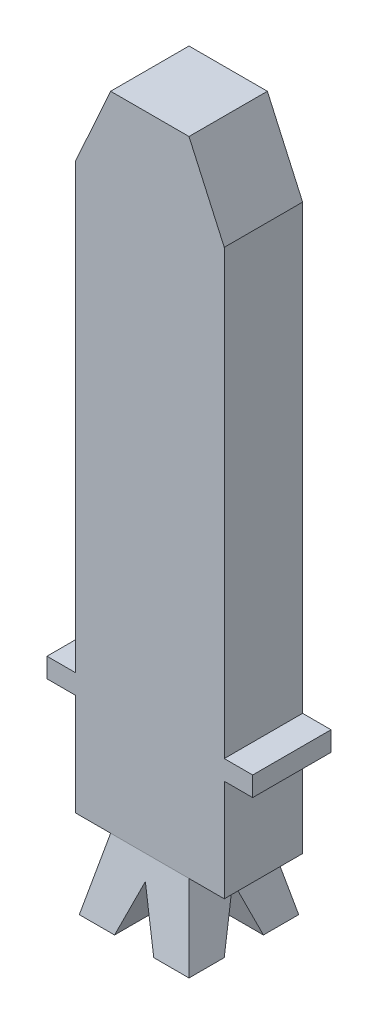
ISO-10303-21;
HEADER;
FILE_DESCRIPTION(('STEP AP214'),'2;1');
FILE_NAME('part.step','',(''),(''),'','','');
FILE_SCHEMA(('AUTOMOTIVE_DESIGN { 1 0 10303 214 1 1 1 1 }'));
ENDSEC;
DATA;
#1=APPLICATION_CONTEXT('core data for automotive mechanical design processes');
#2=APPLICATION_PROTOCOL_DEFINITION('international standard','automotive_design',2000,#1);
#3=PRODUCT_CONTEXT('',#1,'mechanical');
#4=PRODUCT('Part','Part','',(#3));
#5=PRODUCT_RELATED_PRODUCT_CATEGORY('part','',(#4));
#6=PRODUCT_DEFINITION_FORMATION('','',#4);
#7=PRODUCT_DEFINITION_CONTEXT('part definition',#1,'design');
#8=PRODUCT_DEFINITION('design','',#6,#7);
#9=PRODUCT_DEFINITION_SHAPE('','',#8);
#10=(LENGTH_UNIT() NAMED_UNIT(*) SI_UNIT(.MILLI.,.METRE.));
#11=(NAMED_UNIT(*) PLANE_ANGLE_UNIT() SI_UNIT($,.RADIAN.));
#12=(NAMED_UNIT(*) SI_UNIT($,.STERADIAN.) SOLID_ANGLE_UNIT());
#13=UNCERTAINTY_MEASURE_WITH_UNIT(LENGTH_MEASURE(1.E-05),#10,'distance_accuracy_value','');
#14=(GEOMETRIC_REPRESENTATION_CONTEXT(3) GLOBAL_UNCERTAINTY_ASSIGNED_CONTEXT((#13)) GLOBAL_UNIT_ASSIGNED_CONTEXT((#10,
#11,#12)) REPRESENTATION_CONTEXT('',''));
#15=CARTESIAN_POINT('',(0.,0.,0.));
#16=DIRECTION('',(0.,0.,1.));
#17=DIRECTION('',(1.,0.,0.));
#18=AXIS2_PLACEMENT_3D('',#15,#16,#17);
#19=CARTESIAN_POINT('',(0.,-4.9,0.));
#20=DIRECTION('',(0.,-1.,0.));
#21=DIRECTION('',(0.,0.,-1.));
#22=AXIS2_PLACEMENT_3D('',#19,#20,#21);
#23=PLANE('',#22);
#24=DIRECTION('',(-1.,0.,0.));
#25=VECTOR('',#24,1.);
#26=CARTESIAN_POINT('',(2.625,-4.9,1.5));
#27=LINE('',#26,#25);
#28=CARTESIAN_POINT('',(1.4,-4.9,1.5));
#29=VERTEX_POINT('',#28);
#30=CARTESIAN_POINT('',(0.5,-4.9,1.5));
#31=VERTEX_POINT('',#30);
#32=EDGE_CURVE('E479',#29,#31,#27,.T.);
#33=ORIENTED_EDGE('',*,*,#32,.F.);
#34=DIRECTION('',(0.,0.,1.));
#35=VECTOR('',#34,1.);
#36=CARTESIAN_POINT('',(1.4,-4.9,-0.4));
#37=LINE('',#36,#35);
#38=CARTESIAN_POINT('',(1.4,-4.9,2.4));
#39=VERTEX_POINT('',#38);
#40=EDGE_CURVE('E181',#29,#39,#37,.T.);
#41=ORIENTED_EDGE('',*,*,#40,.T.);
#42=DIRECTION('',(-1.,0.,0.));
#43=VECTOR('',#42,1.);
#44=CARTESIAN_POINT('',(1.4,-4.9,2.4));
#45=LINE('',#44,#43);
#46=CARTESIAN_POINT('',(0.500000000000001,-4.9,2.4));
#47=VERTEX_POINT('',#46);
#48=EDGE_CURVE('E356',#39,#47,#45,.T.);
#49=ORIENTED_EDGE('',*,*,#48,.T.);
#50=DIRECTION('',(0.,0.,1.));
#51=VECTOR('',#50,1.);
#52=CARTESIAN_POINT('',(0.500000000000001,-4.9,-0.4001));
#53=LINE('',#52,#51);
#54=EDGE_CURVE('E327',#31,#47,#53,.T.);
#55=ORIENTED_EDGE('',*,*,#54,.F.);
#56=EDGE_LOOP('',(#33,#41,#49,#55));
#57=FACE_BOUND('',#56,.T.);
#58=ADVANCED_FACE('F53',(#57),#23,.T.);
#59=CARTESIAN_POINT('',(-0.499999999999999,-4.9,1.5));
#60=VERTEX_POINT('',#59);
#61=CARTESIAN_POINT('',(-1.4,-4.9,1.5));
#62=VERTEX_POINT('',#61);
#63=EDGE_CURVE('E160',#60,#62,#27,.T.);
#64=ORIENTED_EDGE('',*,*,#63,.F.);
#65=DIRECTION('',(0.,0.,1.));
#66=VECTOR('',#65,1.);
#67=CARTESIAN_POINT('',(-0.499999999999999,-4.9,-0.4001));
#68=LINE('',#67,#66);
#69=CARTESIAN_POINT('',(-0.499999999999999,-4.9,2.4));
#70=VERTEX_POINT('',#69);
#71=EDGE_CURVE('E360',#60,#70,#68,.T.);
#72=ORIENTED_EDGE('',*,*,#71,.T.);
#73=CARTESIAN_POINT('',(-1.4,-4.9,2.4));
#74=VERTEX_POINT('',#73);
#75=EDGE_CURVE('E180',#70,#74,#45,.T.);
#76=ORIENTED_EDGE('',*,*,#75,.T.);
#77=DIRECTION('',(0.,0.,-1.));
#78=VECTOR('',#77,1.);
#79=CARTESIAN_POINT('',(-1.4,-4.9,-0.4));
#80=LINE('',#79,#78);
#81=EDGE_CURVE('E390',#74,#62,#80,.T.);
#82=ORIENTED_EDGE('',*,*,#81,.T.);
#83=EDGE_LOOP('',(#64,#72,#76,#82));
#84=FACE_BOUND('',#83,.T.);
#85=ADVANCED_FACE('F519',(#84),#23,.T.);
#86=CARTESIAN_POINT('',(0.500000000000001,-4.9,-0.4001));
#87=DIRECTION('',(0.932267960991806,0.361768501818747,0.));
#88=DIRECTION('',(-0.361768501818747,0.932267960991806,0.));
#89=AXIS2_PLACEMENT_3D('',#86,#87,#88);
#90=PLANE('',#89);
#91=DIRECTION('',(0.,0.,1.));
#92=VECTOR('',#91,1.);
#93=CARTESIAN_POINT('',(0.,-3.61151308598601,-0.4001));
#94=LINE('',#93,#92);
#95=CARTESIAN_POINT('',(0.,-3.611513085986,0.999999999999999));
#96=VERTEX_POINT('',#95);
#97=CARTESIAN_POINT('',(0.,-3.611513085986,2.11366957466356));
#98=VERTEX_POINT('',#97);
#99=EDGE_CURVE('E473',#96,#98,#94,.T.);
#100=ORIENTED_EDGE('',*,*,#99,.F.);
#101=DIRECTION('',(0.340191275432694,-0.876664013313512,0.340191275432694));
#102=VECTOR('',#101,1.);
#103=CARTESIAN_POINT('',(0.280101229616619,-4.33332662390649,1.28010122961662));
#104=LINE('',#103,#102);
#105=EDGE_CURVE('E172',#96,#31,#104,.T.);
#106=ORIENTED_EDGE('',*,*,#105,.T.);
#107=ORIENTED_EDGE('',*,*,#54,.T.);
#108=DIRECTION('',(0.354246297399246,-0.912883437073675,0.202862986016372));
#109=VECTOR('',#108,1.);
#110=CARTESIAN_POINT('',(-1.3198068575803,-0.210405355949719,1.35786785687772));
#111=LINE('',#110,#109);
#112=EDGE_CURVE('E320',#98,#47,#111,.T.);
#113=ORIENTED_EDGE('',*,*,#112,.F.);
#114=EDGE_LOOP('',(#100,#106,#107,#113));
#115=FACE_BOUND('',#114,.T.);
#116=ADVANCED_FACE('F476',(#115),#90,.F.);
#117=CARTESIAN_POINT('',(0.,-3.61151308598601,-0.4001));
#118=DIRECTION('',(-0.932267960991806,0.361768501818746,0.));
#119=DIRECTION('',(-0.361768501818746,-0.932267960991806,0.));
#120=AXIS2_PLACEMENT_3D('',#117,#118,#119);
#121=PLANE('',#120);
#122=ORIENTED_EDGE('',*,*,#71,.F.);
#123=DIRECTION('',(0.340191275432693,0.876664013313513,-0.340191275432694));
#124=VECTOR('',#123,1.);
#125=CARTESIAN_POINT('',(0.16203371844312,-3.19395643430003,0.837966281556879));
#126=LINE('',#125,#124);
#127=EDGE_CURVE('E13',#60,#96,#126,.T.);
#128=ORIENTED_EDGE('',*,*,#127,.T.);
#129=ORIENTED_EDGE('',*,*,#99,.T.);
#130=DIRECTION('',(0.354246297399245,0.912883437073675,-0.202862986016372));
#131=VECTOR('',#130,1.);
#132=CARTESIAN_POINT('',(1.3198068575803,-0.210405355949717,1.35786785687771));
#133=LINE('',#132,#131);
#134=EDGE_CURVE('E323',#70,#98,#133,.T.);
#135=ORIENTED_EDGE('',*,*,#134,.F.);
#136=EDGE_LOOP('',(#122,#128,#129,#135));
#137=FACE_BOUND('',#136,.T.);
#138=ADVANCED_FACE('F471',(#137),#121,.F.);
#139=DIRECTION('',(-1.,0.,0.));
#140=VECTOR('',#139,1.);
#141=CARTESIAN_POINT('',(2.625,-4.9,0.499999999999999));
#142=LINE('',#141,#140);
#143=CARTESIAN_POINT('',(1.4,-4.9,0.499999999999999));
#144=VERTEX_POINT('',#143);
#145=CARTESIAN_POINT('',(0.5,-4.9,0.499999999999999));
#146=VERTEX_POINT('',#145);
#147=EDGE_CURVE('E149',#144,#146,#142,.T.);
#148=ORIENTED_EDGE('',*,*,#147,.T.);
#149=CARTESIAN_POINT('',(0.500000000000001,-4.9,-0.4));
#150=VERTEX_POINT('',#149);
#151=EDGE_CURVE('E324',#150,#146,#53,.T.);
#152=ORIENTED_EDGE('',*,*,#151,.F.);
#153=DIRECTION('',(1.,0.,0.));
#154=VECTOR('',#153,1.);
#155=CARTESIAN_POINT('',(1.4,-4.9,-0.4));
#156=LINE('',#155,#154);
#157=CARTESIAN_POINT('',(1.4,-4.9,-0.4));
#158=VERTEX_POINT('',#157);
#159=EDGE_CURVE('E178',#150,#158,#156,.T.);
#160=ORIENTED_EDGE('',*,*,#159,.T.);
#161=EDGE_CURVE('E168',#158,#144,#37,.T.);
#162=ORIENTED_EDGE('',*,*,#161,.T.);
#163=EDGE_LOOP('',(#148,#152,#160,#162));
#164=FACE_BOUND('',#163,.T.);
#165=ADVANCED_FACE('F176',(#164),#23,.T.);
#166=CARTESIAN_POINT('',(-0.499999999999999,-4.9,0.499999999999999));
#167=VERTEX_POINT('',#166);
#168=CARTESIAN_POINT('',(-1.4,-4.9,0.499999999999999));
#169=VERTEX_POINT('',#168);
#170=EDGE_CURVE('E72',#167,#169,#142,.T.);
#171=ORIENTED_EDGE('',*,*,#170,.T.);
#172=CARTESIAN_POINT('',(-1.4,-4.9,-0.4));
#173=VERTEX_POINT('',#172);
#174=EDGE_CURVE('E58',#169,#173,#80,.T.);
#175=ORIENTED_EDGE('',*,*,#174,.T.);
#176=CARTESIAN_POINT('',(-0.499999999999999,-4.9,-0.4));
#177=VERTEX_POINT('',#176);
#178=EDGE_CURVE('E250',#173,#177,#156,.T.);
#179=ORIENTED_EDGE('',*,*,#178,.T.);
#180=EDGE_CURVE('E79',#177,#167,#68,.T.);
#181=ORIENTED_EDGE('',*,*,#180,.T.);
#182=EDGE_LOOP('',(#171,#175,#179,#181));
#183=FACE_BOUND('',#182,.T.);
#184=ADVANCED_FACE('F55',(#183),#23,.T.);
#185=CARTESIAN_POINT('',(0.,-3.1,0.));
#186=DIRECTION('',(0.,-1.,0.));
#187=DIRECTION('',(0.,0.,-1.));
#188=AXIS2_PLACEMENT_3D('',#185,#186,#187);
#189=PLANE('',#188);
#190=DIRECTION('',(0.,0.,-1.));
#191=VECTOR('',#190,1.);
#192=CARTESIAN_POINT('',(-1.,-3.1,2.));
#193=LINE('',#192,#191);
#194=CARTESIAN_POINT('',(-1.,-3.1,2.));
#195=VERTEX_POINT('',#194);
#196=CARTESIAN_POINT('',(-1.,-3.1,0.));
#197=VERTEX_POINT('',#196);
#198=EDGE_CURVE('E298',#195,#197,#193,.T.);
#199=ORIENTED_EDGE('',*,*,#198,.F.);
#200=DIRECTION('',(-1.,0.,0.));
#201=VECTOR('',#200,1.);
#202=CARTESIAN_POINT('',(-1.,-3.1,2.));
#203=LINE('',#202,#201);
#204=CARTESIAN_POINT('',(1.,-3.1,2.));
#205=VERTEX_POINT('',#204);
#206=EDGE_CURVE('E303',#205,#195,#203,.T.);
#207=ORIENTED_EDGE('',*,*,#206,.F.);
#208=DIRECTION('',(0.,0.,1.));
#209=VECTOR('',#208,1.);
#210=CARTESIAN_POINT('',(1.,-3.1,2.));
#211=LINE('',#210,#209);
#212=CARTESIAN_POINT('',(1.,-3.1,0.));
#213=VERTEX_POINT('',#212);
#214=EDGE_CURVE('E406',#213,#205,#211,.T.);
#215=ORIENTED_EDGE('',*,*,#214,.F.);
#216=DIRECTION('',(1.,0.,0.));
#217=VECTOR('',#216,1.);
#218=CARTESIAN_POINT('',(-1.,-3.1,0.));
#219=LINE('',#218,#217);
#220=EDGE_CURVE('E438',#197,#213,#219,.T.);
#221=ORIENTED_EDGE('',*,*,#220,.F.);
#222=EDGE_LOOP('',(#199,#207,#215,#221));
#223=FACE_BOUND('',#222,.T.);
#224=ADVANCED_FACE('F416',(#223),#189,.F.);
#225=CARTESIAN_POINT('',(0.,0.277647058823529,1.24941176470588));
#226=DIRECTION('',(0.,-0.216930457818656,-0.976187060183953));
#227=DIRECTION('',(0.,0.976187060183953,-0.216930457818656));
#228=AXIS2_PLACEMENT_3D('',#225,#226,#227);
#229=PLANE('',#228);
#230=ORIENTED_EDGE('',*,*,#134,.T.);
#231=ORIENTED_EDGE('',*,*,#112,.T.);
#232=ORIENTED_EDGE('',*,*,#48,.F.);
#233=DIRECTION('',(0.211999576001272,-0.953998092005724,0.211999576001272));
#234=VECTOR('',#233,1.);
#235=CARTESIAN_POINT('',(1.,-3.1,2.));
#236=LINE('',#235,#234);
#237=EDGE_CURVE('E280',#205,#39,#236,.T.);
#238=ORIENTED_EDGE('',*,*,#237,.F.);
#239=ORIENTED_EDGE('',*,*,#206,.T.);
#240=DIRECTION('',(-0.211999576001272,-0.953998092005724,0.211999576001272));
#241=VECTOR('',#240,1.);
#242=CARTESIAN_POINT('',(-1.,-3.1,2.));
#243=LINE('',#242,#241);
#244=EDGE_CURVE('E284',#195,#74,#243,.T.);
#245=ORIENTED_EDGE('',*,*,#244,.T.);
#246=ORIENTED_EDGE('',*,*,#75,.F.);
#247=EDGE_LOOP('',(#230,#231,#232,#238,#239,#245,#246));
#248=FACE_BOUND('',#247,.T.);
#249=ADVANCED_FACE('F229',(#248),#229,.F.);
#250=CARTESIAN_POINT('',(0.296470588235295,0.0658823529411766,0.));
#251=DIRECTION('',(-0.976187060183953,-0.216930457818656,0.));
#252=DIRECTION('',(0.216930457818656,-0.976187060183953,0.));
#253=AXIS2_PLACEMENT_3D('',#250,#251,#252);
#254=PLANE('',#253);
#255=ORIENTED_EDGE('',*,*,#40,.F.);
#256=DIRECTION('',(-0.202862986016372,0.912883437073675,-0.354246297399246));
#257=VECTOR('',#256,1.);
#258=CARTESIAN_POINT('',(0.32715778629754,-0.0722100383389264,-0.373433835125718));
#259=LINE('',#258,#257);
#260=CARTESIAN_POINT('',(1.11366957466356,-3.611513085986,0.999999999999998));
#261=VERTEX_POINT('',#260);
#262=EDGE_CURVE('E171',#29,#261,#259,.T.);
#263=ORIENTED_EDGE('',*,*,#262,.T.);
#264=DIRECTION('',(0.202862986016372,-0.912883437073675,-0.354246297399245));
#265=VECTOR('',#264,1.);
#266=CARTESIAN_POINT('',(0.470884709648849,-0.718981193419817,2.12245295668356));
#267=LINE('',#266,#265);
#268=EDGE_CURVE('E152',#261,#144,#267,.T.);
#269=ORIENTED_EDGE('',*,*,#268,.T.);
#270=ORIENTED_EDGE('',*,*,#161,.F.);
#271=DIRECTION('',(0.211999576001272,-0.953998092005724,-0.211999576001272));
#272=VECTOR('',#271,1.);
#273=CARTESIAN_POINT('',(1.,-3.1,0.));
#274=LINE('',#273,#272);
#275=EDGE_CURVE('E271',#213,#158,#274,.T.);
#276=ORIENTED_EDGE('',*,*,#275,.F.);
#277=ORIENTED_EDGE('',*,*,#214,.T.);
#278=ORIENTED_EDGE('',*,*,#237,.T.);
#279=EDGE_LOOP('',(#255,#263,#269,#270,#276,#277,#278));
#280=FACE_BOUND('',#279,.T.);
#281=ADVANCED_FACE('F166',(#280),#254,.F.);
#282=CARTESIAN_POINT('',(-0.296470588235294,0.0658823529411765,0.));
#283=DIRECTION('',(0.976187060183953,-0.216930457818656,0.));
#284=DIRECTION('',(0.216930457818656,0.976187060183953,0.));
#285=AXIS2_PLACEMENT_3D('',#282,#283,#284);
#286=PLANE('',#285);
#287=DIRECTION('',(0.202862986016372,0.912883437073675,0.354246297399245));
#288=VECTOR('',#287,1.);
#289=CARTESIAN_POINT('',(-0.470884709648848,-0.718981193419817,2.12245295668357));
#290=LINE('',#289,#288);
#291=CARTESIAN_POINT('',(-1.11366957466356,-3.611513085986,0.999999999999999));
#292=VERTEX_POINT('',#291);
#293=EDGE_CURVE('E173',#169,#292,#290,.T.);
#294=ORIENTED_EDGE('',*,*,#293,.T.);
#295=DIRECTION('',(-0.202862986016372,-0.912883437073675,0.354246297399246));
#296=VECTOR('',#295,1.);
#297=CARTESIAN_POINT('',(-0.327157786297539,-0.0722100383389265,-0.373433835125718));
#298=LINE('',#297,#296);
#299=EDGE_CURVE('E501',#292,#62,#298,.T.);
#300=ORIENTED_EDGE('',*,*,#299,.T.);
#301=ORIENTED_EDGE('',*,*,#81,.F.);
#302=ORIENTED_EDGE('',*,*,#244,.F.);
#303=ORIENTED_EDGE('',*,*,#198,.T.);
#304=DIRECTION('',(-0.211999576001272,-0.953998092005724,-0.211999576001272));
#305=VECTOR('',#304,1.);
#306=CARTESIAN_POINT('',(-1.,-3.1,0.));
#307=LINE('',#306,#305);
#308=EDGE_CURVE('E277',#197,#173,#307,.T.);
#309=ORIENTED_EDGE('',*,*,#308,.T.);
#310=ORIENTED_EDGE('',*,*,#174,.F.);
#311=EDGE_LOOP('',(#294,#300,#301,#302,#303,#309,#310));
#312=FACE_BOUND('',#311,.T.);
#313=ADVANCED_FACE('F228',(#312),#286,.F.);
#314=CARTESIAN_POINT('',(0.,-0.145882352941177,0.656470588235294));
#315=DIRECTION('',(0.,-0.216930457818656,0.976187060183953));
#316=DIRECTION('',(0.,-0.976187060183953,-0.216930457818656));
#317=AXIS2_PLACEMENT_3D('',#314,#315,#316);
#318=PLANE('',#317);
#319=ORIENTED_EDGE('',*,*,#159,.F.);
#320=DIRECTION('',(-0.354246297399246,0.912883437073675,0.202862986016372));
#321=VECTOR('',#320,1.);
#322=CARTESIAN_POINT('',(-1.17607993422899,-0.580785875809028,0.559825360931327));
#323=LINE('',#322,#321);
#324=CARTESIAN_POINT('',(0.,-3.611513085986,-0.113669574663557));
#325=VERTEX_POINT('',#324);
#326=EDGE_CURVE('E362',#150,#325,#323,.T.);
#327=ORIENTED_EDGE('',*,*,#326,.T.);
#328=DIRECTION('',(-0.354246297399245,-0.912883437073675,-0.202862986016372));
#329=VECTOR('',#328,1.);
#330=CARTESIAN_POINT('',(1.17607993422899,-0.580785875809026,0.559825360931328));
#331=LINE('',#330,#329);
#332=EDGE_CURVE('E365',#325,#177,#331,.T.);
#333=ORIENTED_EDGE('',*,*,#332,.T.);
#334=ORIENTED_EDGE('',*,*,#178,.F.);
#335=ORIENTED_EDGE('',*,*,#308,.F.);
#336=ORIENTED_EDGE('',*,*,#220,.T.);
#337=ORIENTED_EDGE('',*,*,#275,.T.);
#338=EDGE_LOOP('',(#319,#327,#333,#334,#335,#336,#337));
#339=FACE_BOUND('',#338,.T.);
#340=ADVANCED_FACE('F254',(#339),#318,.F.);
#341=ORIENTED_EDGE('',*,*,#151,.T.);
#342=DIRECTION('',(-0.340191275432694,0.876664013313513,0.340191275432693));
#343=VECTOR('',#342,1.);
#344=CARTESIAN_POINT('',(0.604168666502859,-5.16843992727844,0.395831333497141));
#345=LINE('',#344,#343);
#346=EDGE_CURVE('E155',#146,#96,#345,.T.);
#347=ORIENTED_EDGE('',*,*,#346,.T.);
#348=EDGE_CURVE('E361',#325,#96,#94,.T.);
#349=ORIENTED_EDGE('',*,*,#348,.F.);
#350=ORIENTED_EDGE('',*,*,#326,.F.);
#351=EDGE_LOOP('',(#341,#347,#349,#350));
#352=FACE_BOUND('',#351,.T.);
#353=ADVANCED_FACE('F262',(#352),#90,.F.);
#354=ORIENTED_EDGE('',*,*,#348,.T.);
#355=DIRECTION('',(-0.340191275432693,-0.876664013313513,-0.340191275432693));
#356=VECTOR('',#355,1.);
#357=CARTESIAN_POINT('',(-0.16203371844312,-4.02906973767198,0.837966281556879));
#358=LINE('',#357,#356);
#359=EDGE_CURVE('E64',#96,#167,#358,.T.);
#360=ORIENTED_EDGE('',*,*,#359,.T.);
#361=ORIENTED_EDGE('',*,*,#180,.F.);
#362=ORIENTED_EDGE('',*,*,#332,.F.);
#363=EDGE_LOOP('',(#354,#360,#361,#362));
#364=FACE_BOUND('',#363,.T.);
#365=ADVANCED_FACE('F530',(#364),#121,.F.);
#366=CARTESIAN_POINT('',(2.625,-3.611513085986,0.999999999999999));
#367=DIRECTION('',(0.,0.361768501818746,-0.932267960991806));
#368=DIRECTION('',(0.,0.932267960991806,0.361768501818746));
#369=AXIS2_PLACEMENT_3D('',#366,#367,#368);
#370=PLANE('',#369);
#371=ORIENTED_EDGE('',*,*,#170,.F.);
#372=ORIENTED_EDGE('',*,*,#359,.F.);
#373=DIRECTION('',(-1.,0.,0.));
#374=VECTOR('',#373,1.);
#375=CARTESIAN_POINT('',(2.625,-3.611513085986,0.999999999999999));
#376=LINE('',#375,#374);
#377=EDGE_CURVE('E493',#96,#292,#376,.T.);
#378=ORIENTED_EDGE('',*,*,#377,.T.);
#379=ORIENTED_EDGE('',*,*,#293,.F.);
#380=EDGE_LOOP('',(#371,#372,#378,#379));
#381=FACE_BOUND('',#380,.T.);
#382=ADVANCED_FACE('F503',(#381),#370,.F.);
#383=CARTESIAN_POINT('',(2.625,-4.9,1.5));
#384=DIRECTION('',(0.,0.361768501818747,0.932267960991806));
#385=DIRECTION('',(0.,-0.932267960991806,0.361768501818747));
#386=AXIS2_PLACEMENT_3D('',#383,#384,#385);
#387=PLANE('',#386);
#388=ORIENTED_EDGE('',*,*,#377,.F.);
#389=ORIENTED_EDGE('',*,*,#127,.F.);
#390=ORIENTED_EDGE('',*,*,#63,.T.);
#391=ORIENTED_EDGE('',*,*,#299,.F.);
#392=EDGE_LOOP('',(#388,#389,#390,#391));
#393=FACE_BOUND('',#392,.T.);
#394=ADVANCED_FACE('F511',(#393),#387,.F.);
#395=ORIENTED_EDGE('',*,*,#32,.T.);
#396=ORIENTED_EDGE('',*,*,#105,.F.);
#397=EDGE_CURVE('E496',#261,#96,#376,.T.);
#398=ORIENTED_EDGE('',*,*,#397,.F.);
#399=ORIENTED_EDGE('',*,*,#262,.F.);
#400=EDGE_LOOP('',(#395,#396,#398,#399));
#401=FACE_BOUND('',#400,.T.);
#402=ADVANCED_FACE('F506',(#401),#387,.F.);
#403=ORIENTED_EDGE('',*,*,#397,.T.);
#404=ORIENTED_EDGE('',*,*,#346,.F.);
#405=ORIENTED_EDGE('',*,*,#147,.F.);
#406=ORIENTED_EDGE('',*,*,#268,.F.);
#407=EDGE_LOOP('',(#403,#404,#405,#406));
#408=FACE_BOUND('',#407,.T.);
#409=ADVANCED_FACE('F151',(#408),#370,.F.);
#410=CLOSED_SHELL('',(#58,#85,#116,#138,#165,#184,#224,#249,#281,#313,#340,#353,#365,#382,#394,
#402,#409));
#411=MANIFOLD_SOLID_BREP('B2',#410);
#412=CARTESIAN_POINT('',(-1.9,11.3,2.));
#413=DIRECTION('',(0.911921505175107,-0.410364677328798,0.));
#414=DIRECTION('',(0.410364677328798,0.911921505175107,0.));
#415=AXIS2_PLACEMENT_3D('',#412,#413,#414);
#416=PLANE('',#415);
#417=DIRECTION('',(-0.410364677328798,-0.911921505175106,0.));
#418=VECTOR('',#417,1.);
#419=CARTESIAN_POINT('',(-1.9,11.3,0.));
#420=LINE('',#419,#418);
#421=CARTESIAN_POINT('',(-1.,13.3,0.));
#422=VERTEX_POINT('',#421);
#423=CARTESIAN_POINT('',(-1.9,11.3,0.));
#424=VERTEX_POINT('',#423);
#425=EDGE_CURVE('E804',#422,#424,#420,.T.);
#426=ORIENTED_EDGE('',*,*,#425,.T.);
#427=DIRECTION('',(0.,0.,-1.));
#428=VECTOR('',#427,1.);
#429=CARTESIAN_POINT('',(-1.9,11.3,2.));
#430=LINE('',#429,#428);
#431=CARTESIAN_POINT('',(-1.9,11.3,2.));
#432=VERTEX_POINT('',#431);
#433=EDGE_CURVE('E51',#432,#424,#430,.T.);
#434=ORIENTED_EDGE('',*,*,#433,.F.);
#435=DIRECTION('',(-0.410364677328798,-0.911921505175106,0.));
#436=VECTOR('',#435,1.);
#437=CARTESIAN_POINT('',(-1.9,11.3,2.));
#438=LINE('',#437,#436);
#439=CARTESIAN_POINT('',(-1.,13.3,2.));
#440=VERTEX_POINT('',#439);
#441=EDGE_CURVE('E830',#440,#432,#438,.T.);
#442=ORIENTED_EDGE('',*,*,#441,.F.);
#443=DIRECTION('',(0.,0.,-1.));
#444=VECTOR('',#443,1.);
#445=CARTESIAN_POINT('',(-1.,13.3,2.));
#446=LINE('',#445,#444);
#447=EDGE_CURVE('E800',#440,#422,#446,.T.);
#448=ORIENTED_EDGE('',*,*,#447,.T.);
#449=EDGE_LOOP('',(#426,#434,#442,#448));
#450=FACE_BOUND('',#449,.T.);
#451=ADVANCED_FACE('F672',(#450),#416,.F.);
#452=CARTESIAN_POINT('',(-1.9,11.3,2.));
#453=DIRECTION('',(1.,0.,0.));
#454=DIRECTION('',(0.,1.,0.));
#455=AXIS2_PLACEMENT_3D('',#452,#453,#454);
#456=PLANE('',#455);
#457=DIRECTION('',(0.,-1.,0.));
#458=VECTOR('',#457,1.);
#459=CARTESIAN_POINT('',(-1.9,11.3,0.));
#460=LINE('',#459,#458);
#461=CARTESIAN_POINT('',(-1.9,0.,0.));
#462=VERTEX_POINT('',#461);
#463=EDGE_CURVE('E807',#424,#462,#460,.T.);
#464=ORIENTED_EDGE('',*,*,#463,.T.);
#465=DIRECTION('',(0.,0.,-1.));
#466=VECTOR('',#465,1.);
#467=CARTESIAN_POINT('',(-1.9,0.,2.));
#468=LINE('',#467,#466);
#469=CARTESIAN_POINT('',(-1.9,0.,2.));
#470=VERTEX_POINT('',#469);
#471=EDGE_CURVE('E680',#470,#462,#468,.T.);
#472=ORIENTED_EDGE('',*,*,#471,.F.);
#473=DIRECTION('',(0.,-1.,0.));
#474=VECTOR('',#473,1.);
#475=CARTESIAN_POINT('',(-1.9,11.3,2.));
#476=LINE('',#475,#474);
#477=EDGE_CURVE('E749',#432,#470,#476,.T.);
#478=ORIENTED_EDGE('',*,*,#477,.F.);
#479=ORIENTED_EDGE('',*,*,#433,.T.);
#480=EDGE_LOOP('',(#464,#472,#478,#479));
#481=FACE_BOUND('',#480,.T.);
#482=ADVANCED_FACE('F918',(#481),#456,.F.);
#483=CARTESIAN_POINT('',(-2.625,0.,2.));
#484=DIRECTION('',(0.,-1.,0.));
#485=DIRECTION('',(1.,0.,0.));
#486=AXIS2_PLACEMENT_3D('',#483,#484,#485);
#487=PLANE('',#486);
#488=DIRECTION('',(-1.,0.,0.));
#489=VECTOR('',#488,1.);
#490=CARTESIAN_POINT('',(-2.625,0.,0.));
#491=LINE('',#490,#489);
#492=CARTESIAN_POINT('',(-2.625,0.,0.));
#493=VERTEX_POINT('',#492);
#494=EDGE_CURVE('E809',#462,#493,#491,.T.);
#495=ORIENTED_EDGE('',*,*,#494,.T.);
#496=DIRECTION('',(0.,0.,-1.));
#497=VECTOR('',#496,1.);
#498=CARTESIAN_POINT('',(-2.625,0.,2.));
#499=LINE('',#498,#497);
#500=CARTESIAN_POINT('',(-2.625,0.,2.));
#501=VERTEX_POINT('',#500);
#502=EDGE_CURVE('E855',#501,#493,#499,.T.);
#503=ORIENTED_EDGE('',*,*,#502,.F.);
#504=DIRECTION('',(-1.,0.,0.));
#505=VECTOR('',#504,1.);
#506=CARTESIAN_POINT('',(-2.625,0.,2.));
#507=LINE('',#506,#505);
#508=EDGE_CURVE('E863',#470,#501,#507,.T.);
#509=ORIENTED_EDGE('',*,*,#508,.F.);
#510=ORIENTED_EDGE('',*,*,#471,.T.);
#511=EDGE_LOOP('',(#495,#503,#509,#510));
#512=FACE_BOUND('',#511,.T.);
#513=ADVANCED_FACE('F861',(#512),#487,.F.);
#514=CARTESIAN_POINT('',(-2.625,0.,2.));
#515=DIRECTION('',(1.,0.,0.));
#516=DIRECTION('',(0.,0.,-1.));
#517=AXIS2_PLACEMENT_3D('',#514,#515,#516);
#518=PLANE('',#517);
#519=DIRECTION('',(0.,-1.,0.));
#520=VECTOR('',#519,1.);
#521=CARTESIAN_POINT('',(-2.625,0.,0.));
#522=LINE('',#521,#520);
#523=CARTESIAN_POINT('',(-2.625,-0.5,0.));
#524=VERTEX_POINT('',#523);
#525=EDGE_CURVE('E811',#493,#524,#522,.T.);
#526=ORIENTED_EDGE('',*,*,#525,.T.);
#527=DIRECTION('',(0.,0.,-1.));
#528=VECTOR('',#527,1.);
#529=CARTESIAN_POINT('',(-2.625,-0.5,2.));
#530=LINE('',#529,#528);
#531=CARTESIAN_POINT('',(-2.625,-0.5,2.));
#532=VERTEX_POINT('',#531);
#533=EDGE_CURVE('E852',#532,#524,#530,.T.);
#534=ORIENTED_EDGE('',*,*,#533,.F.);
#535=DIRECTION('',(0.,-1.,0.));
#536=VECTOR('',#535,1.);
#537=CARTESIAN_POINT('',(-2.625,0.,2.));
#538=LINE('',#537,#536);
#539=EDGE_CURVE('E881',#501,#532,#538,.T.);
#540=ORIENTED_EDGE('',*,*,#539,.F.);
#541=ORIENTED_EDGE('',*,*,#502,.T.);
#542=EDGE_LOOP('',(#526,#534,#540,#541));
#543=FACE_BOUND('',#542,.T.);
#544=ADVANCED_FACE('F872',(#543),#518,.F.);
#545=CARTESIAN_POINT('',(-2.625,-0.5,2.));
#546=DIRECTION('',(0.,1.,0.));
#547=DIRECTION('',(0.,0.,1.));
#548=AXIS2_PLACEMENT_3D('',#545,#546,#547);
#549=PLANE('',#548);
#550=DIRECTION('',(1.,0.,0.));
#551=VECTOR('',#550,1.);
#552=CARTESIAN_POINT('',(-2.625,-0.5,0.));
#553=LINE('',#552,#551);
#554=CARTESIAN_POINT('',(-1.9,-0.5,0.));
#555=VERTEX_POINT('',#554);
#556=EDGE_CURVE('E813',#524,#555,#553,.T.);
#557=ORIENTED_EDGE('',*,*,#556,.T.);
#558=DIRECTION('',(0.,0.,-1.));
#559=VECTOR('',#558,1.);
#560=CARTESIAN_POINT('',(-1.9,-0.5,2.));
#561=LINE('',#560,#559);
#562=CARTESIAN_POINT('',(-1.9,-0.5,2.));
#563=VERTEX_POINT('',#562);
#564=EDGE_CURVE('E849',#563,#555,#561,.T.);
#565=ORIENTED_EDGE('',*,*,#564,.F.);
#566=DIRECTION('',(1.,0.,0.));
#567=VECTOR('',#566,1.);
#568=CARTESIAN_POINT('',(-2.625,-0.5,2.));
#569=LINE('',#568,#567);
#570=EDGE_CURVE('E878',#532,#563,#569,.T.);
#571=ORIENTED_EDGE('',*,*,#570,.F.);
#572=ORIENTED_EDGE('',*,*,#533,.T.);
#573=EDGE_LOOP('',(#557,#565,#571,#572));
#574=FACE_BOUND('',#573,.T.);
#575=ADVANCED_FACE('F876',(#574),#549,.F.);
#576=CARTESIAN_POINT('',(-1.9,-0.5,2.));
#577=DIRECTION('',(1.,0.,0.));
#578=DIRECTION('',(0.,1.,0.));
#579=AXIS2_PLACEMENT_3D('',#576,#577,#578);
#580=PLANE('',#579);
#581=DIRECTION('',(0.,-1.,0.));
#582=VECTOR('',#581,1.);
#583=CARTESIAN_POINT('',(-1.9,-0.5,0.));
#584=LINE('',#583,#582);
#585=CARTESIAN_POINT('',(-1.9,-3.1,0.));
#586=VERTEX_POINT('',#585);
#587=EDGE_CURVE('E815',#555,#586,#584,.T.);
#588=ORIENTED_EDGE('',*,*,#587,.T.);
#589=DIRECTION('',(0.,0.,-1.));
#590=VECTOR('',#589,1.);
#591=CARTESIAN_POINT('',(-1.9,-3.1,2.));
#592=LINE('',#591,#590);
#593=CARTESIAN_POINT('',(-1.9,-3.1,2.));
#594=VERTEX_POINT('',#593);
#595=EDGE_CURVE('E846',#594,#586,#592,.T.);
#596=ORIENTED_EDGE('',*,*,#595,.F.);
#597=DIRECTION('',(0.,-1.,0.));
#598=VECTOR('',#597,1.);
#599=CARTESIAN_POINT('',(-1.9,-0.5,2.));
#600=LINE('',#599,#598);
#601=EDGE_CURVE('E880',#563,#594,#600,.T.);
#602=ORIENTED_EDGE('',*,*,#601,.F.);
#603=ORIENTED_EDGE('',*,*,#564,.T.);
#604=EDGE_LOOP('',(#588,#596,#602,#603));
#605=FACE_BOUND('',#604,.T.);
#606=ADVANCED_FACE('F931',(#605),#580,.F.);
#607=CARTESIAN_POINT('',(-1.9,-3.1,2.));
#608=DIRECTION('',(0.,1.,0.));
#609=DIRECTION('',(0.,0.,1.));
#610=AXIS2_PLACEMENT_3D('',#607,#608,#609);
#611=PLANE('',#610);
#612=DIRECTION('',(1.,0.,0.));
#613=VECTOR('',#612,1.);
#614=CARTESIAN_POINT('',(-1.9,-3.1,0.));
#615=LINE('',#614,#613);
#616=CARTESIAN_POINT('',(1.9,-3.1,0.));
#617=VERTEX_POINT('',#616);
#618=EDGE_CURVE('E817',#586,#617,#615,.T.);
#619=ORIENTED_EDGE('',*,*,#618,.T.);
#620=DIRECTION('',(0.,0.,-1.));
#621=VECTOR('',#620,1.);
#622=CARTESIAN_POINT('',(1.9,-3.1,2.));
#623=LINE('',#622,#621);
#624=CARTESIAN_POINT('',(1.9,-3.1,2.));
#625=VERTEX_POINT('',#624);
#626=EDGE_CURVE('E843',#625,#617,#623,.T.);
#627=ORIENTED_EDGE('',*,*,#626,.F.);
#628=DIRECTION('',(1.,0.,0.));
#629=VECTOR('',#628,1.);
#630=CARTESIAN_POINT('',(-1.9,-3.1,2.));
#631=LINE('',#630,#629);
#632=EDGE_CURVE('E883',#594,#625,#631,.T.);
#633=ORIENTED_EDGE('',*,*,#632,.F.);
#634=ORIENTED_EDGE('',*,*,#595,.T.);
#635=EDGE_LOOP('',(#619,#627,#633,#634));
#636=FACE_BOUND('',#635,.T.);
#637=ADVANCED_FACE('F934',(#636),#611,.F.);
#638=CARTESIAN_POINT('',(1.9,-0.5,2.));
#639=DIRECTION('',(-1.,0.,0.));
#640=DIRECTION('',(0.,-1.,0.));
#641=AXIS2_PLACEMENT_3D('',#638,#639,#640);
#642=PLANE('',#641);
#643=DIRECTION('',(0.,1.,0.));
#644=VECTOR('',#643,1.);
#645=CARTESIAN_POINT('',(1.9,-0.5,0.));
#646=LINE('',#645,#644);
#647=CARTESIAN_POINT('',(1.9,-0.5,0.));
#648=VERTEX_POINT('',#647);
#649=EDGE_CURVE('E819',#617,#648,#646,.T.);
#650=ORIENTED_EDGE('',*,*,#649,.T.);
#651=DIRECTION('',(0.,0.,-1.));
#652=VECTOR('',#651,1.);
#653=CARTESIAN_POINT('',(1.9,-0.5,2.));
#654=LINE('',#653,#652);
#655=CARTESIAN_POINT('',(1.9,-0.5,2.));
#656=VERTEX_POINT('',#655);
#657=EDGE_CURVE('E840',#656,#648,#654,.T.);
#658=ORIENTED_EDGE('',*,*,#657,.F.);
#659=DIRECTION('',(0.,1.,0.));
#660=VECTOR('',#659,1.);
#661=CARTESIAN_POINT('',(1.9,-0.5,2.));
#662=LINE('',#661,#660);
#663=EDGE_CURVE('E889',#625,#656,#662,.T.);
#664=ORIENTED_EDGE('',*,*,#663,.F.);
#665=ORIENTED_EDGE('',*,*,#626,.T.);
#666=EDGE_LOOP('',(#650,#658,#664,#665));
#667=FACE_BOUND('',#666,.T.);
#668=ADVANCED_FACE('F938',(#667),#642,.F.);
#669=CARTESIAN_POINT('',(1.9,-0.5,2.));
#670=DIRECTION('',(0.,1.,0.));
#671=DIRECTION('',(0.,0.,1.));
#672=AXIS2_PLACEMENT_3D('',#669,#670,#671);
#673=PLANE('',#672);
#674=DIRECTION('',(1.,0.,0.));
#675=VECTOR('',#674,1.);
#676=CARTESIAN_POINT('',(1.9,-0.5,0.));
#677=LINE('',#676,#675);
#678=CARTESIAN_POINT('',(2.625,-0.5,0.));
#679=VERTEX_POINT('',#678);
#680=EDGE_CURVE('E821',#648,#679,#677,.T.);
#681=ORIENTED_EDGE('',*,*,#680,.T.);
#682=DIRECTION('',(0.,0.,-1.));
#683=VECTOR('',#682,1.);
#684=CARTESIAN_POINT('',(2.625,-0.5,2.));
#685=LINE('',#684,#683);
#686=CARTESIAN_POINT('',(2.625,-0.5,2.));
#687=VERTEX_POINT('',#686);
#688=EDGE_CURVE('E837',#687,#679,#685,.T.);
#689=ORIENTED_EDGE('',*,*,#688,.F.);
#690=DIRECTION('',(1.,0.,0.));
#691=VECTOR('',#690,1.);
#692=CARTESIAN_POINT('',(1.9,-0.5,2.));
#693=LINE('',#692,#691);
#694=EDGE_CURVE('E891',#656,#687,#693,.T.);
#695=ORIENTED_EDGE('',*,*,#694,.F.);
#696=ORIENTED_EDGE('',*,*,#657,.T.);
#697=EDGE_LOOP('',(#681,#689,#695,#696));
#698=FACE_BOUND('',#697,.T.);
#699=ADVANCED_FACE('F942',(#698),#673,.F.);
#700=CARTESIAN_POINT('',(2.625,0.,2.));
#701=DIRECTION('',(-1.,0.,0.));
#702=DIRECTION('',(0.,0.,1.));
#703=AXIS2_PLACEMENT_3D('',#700,#701,#702);
#704=PLANE('',#703);
#705=DIRECTION('',(0.,1.,0.));
#706=VECTOR('',#705,1.);
#707=CARTESIAN_POINT('',(2.625,0.,0.));
#708=LINE('',#707,#706);
#709=CARTESIAN_POINT('',(2.625,0.,0.));
#710=VERTEX_POINT('',#709);
#711=EDGE_CURVE('E823',#679,#710,#708,.T.);
#712=ORIENTED_EDGE('',*,*,#711,.T.);
#713=DIRECTION('',(0.,0.,-1.));
#714=VECTOR('',#713,1.);
#715=CARTESIAN_POINT('',(2.625,0.,2.));
#716=LINE('',#715,#714);
#717=CARTESIAN_POINT('',(2.625,0.,2.));
#718=VERTEX_POINT('',#717);
#719=EDGE_CURVE('E834',#718,#710,#716,.T.);
#720=ORIENTED_EDGE('',*,*,#719,.F.);
#721=DIRECTION('',(0.,1.,0.));
#722=VECTOR('',#721,1.);
#723=CARTESIAN_POINT('',(2.625,0.,2.));
#724=LINE('',#723,#722);
#725=EDGE_CURVE('E893',#687,#718,#724,.T.);
#726=ORIENTED_EDGE('',*,*,#725,.F.);
#727=ORIENTED_EDGE('',*,*,#688,.T.);
#728=EDGE_LOOP('',(#712,#720,#726,#727));
#729=FACE_BOUND('',#728,.T.);
#730=ADVANCED_FACE('F899',(#729),#704,.F.);
#731=CARTESIAN_POINT('',(1.9,0.,2.));
#732=DIRECTION('',(0.,-1.,0.));
#733=DIRECTION('',(1.,0.,0.));
#734=AXIS2_PLACEMENT_3D('',#731,#732,#733);
#735=PLANE('',#734);
#736=DIRECTION('',(-1.,0.,0.));
#737=VECTOR('',#736,1.);
#738=CARTESIAN_POINT('',(1.9,0.,0.));
#739=LINE('',#738,#737);
#740=CARTESIAN_POINT('',(1.9,0.,0.));
#741=VERTEX_POINT('',#740);
#742=EDGE_CURVE('E825',#710,#741,#739,.T.);
#743=ORIENTED_EDGE('',*,*,#742,.T.);
#744=DIRECTION('',(0.,0.,-1.));
#745=VECTOR('',#744,1.);
#746=CARTESIAN_POINT('',(1.9,0.,2.));
#747=LINE('',#746,#745);
#748=CARTESIAN_POINT('',(1.9,0.,2.));
#749=VERTEX_POINT('',#748);
#750=EDGE_CURVE('E795',#749,#741,#747,.T.);
#751=ORIENTED_EDGE('',*,*,#750,.F.);
#752=DIRECTION('',(-1.,0.,0.));
#753=VECTOR('',#752,1.);
#754=CARTESIAN_POINT('',(1.9,0.,2.));
#755=LINE('',#754,#753);
#756=EDGE_CURVE('E786',#718,#749,#755,.T.);
#757=ORIENTED_EDGE('',*,*,#756,.F.);
#758=ORIENTED_EDGE('',*,*,#719,.T.);
#759=EDGE_LOOP('',(#743,#751,#757,#758));
#760=FACE_BOUND('',#759,.T.);
#761=ADVANCED_FACE('F903',(#760),#735,.F.);
#762=CARTESIAN_POINT('',(1.9,11.3,2.));
#763=DIRECTION('',(-1.,0.,0.));
#764=DIRECTION('',(0.,0.,1.));
#765=AXIS2_PLACEMENT_3D('',#762,#763,#764);
#766=PLANE('',#765);
#767=DIRECTION('',(0.,1.,0.));
#768=VECTOR('',#767,1.);
#769=CARTESIAN_POINT('',(1.9,11.3,0.));
#770=LINE('',#769,#768);
#771=CARTESIAN_POINT('',(1.9,11.3,0.));
#772=VERTEX_POINT('',#771);
#773=EDGE_CURVE('E794',#741,#772,#770,.T.);
#774=ORIENTED_EDGE('',*,*,#773,.T.);
#775=DIRECTION('',(0.,0.,-1.));
#776=VECTOR('',#775,1.);
#777=CARTESIAN_POINT('',(1.9,11.3,2.));
#778=LINE('',#777,#776);
#779=CARTESIAN_POINT('',(1.9,11.3,2.));
#780=VERTEX_POINT('',#779);
#781=EDGE_CURVE('E791',#780,#772,#778,.T.);
#782=ORIENTED_EDGE('',*,*,#781,.F.);
#783=DIRECTION('',(0.,1.,0.));
#784=VECTOR('',#783,1.);
#785=CARTESIAN_POINT('',(1.9,11.3,2.));
#786=LINE('',#785,#784);
#787=EDGE_CURVE('E780',#749,#780,#786,.T.);
#788=ORIENTED_EDGE('',*,*,#787,.F.);
#789=ORIENTED_EDGE('',*,*,#750,.T.);
#790=EDGE_LOOP('',(#774,#782,#788,#789));
#791=FACE_BOUND('',#790,.T.);
#792=ADVANCED_FACE('F792',(#791),#766,.F.);
#793=CARTESIAN_POINT('',(0.999999999999999,13.3,2.));
#794=DIRECTION('',(-0.911921505175106,-0.410364677328798,0.));
#795=DIRECTION('',(0.410364677328798,-0.911921505175107,0.));
#796=AXIS2_PLACEMENT_3D('',#793,#794,#795);
#797=PLANE('',#796);
#798=DIRECTION('',(-0.410364677328798,0.911921505175106,0.));
#799=VECTOR('',#798,1.);
#800=CARTESIAN_POINT('',(0.999999999999999,13.3,0.));
#801=LINE('',#800,#799);
#802=CARTESIAN_POINT('',(0.999999999999999,13.3,0.));
#803=VERTEX_POINT('',#802);
#804=EDGE_CURVE('E735',#772,#803,#801,.T.);
#805=ORIENTED_EDGE('',*,*,#804,.T.);
#806=DIRECTION('',(0.,0.,-1.));
#807=VECTOR('',#806,1.);
#808=CARTESIAN_POINT('',(0.999999999999999,13.3,2.));
#809=LINE('',#808,#807);
#810=CARTESIAN_POINT('',(0.999999999999999,13.3,2.));
#811=VERTEX_POINT('',#810);
#812=EDGE_CURVE('E796',#811,#803,#809,.T.);
#813=ORIENTED_EDGE('',*,*,#812,.F.);
#814=DIRECTION('',(-0.410364677328798,0.911921505175106,0.));
#815=VECTOR('',#814,1.);
#816=CARTESIAN_POINT('',(0.999999999999999,13.3,2.));
#817=LINE('',#816,#815);
#818=EDGE_CURVE('E784',#780,#811,#817,.T.);
#819=ORIENTED_EDGE('',*,*,#818,.F.);
#820=ORIENTED_EDGE('',*,*,#781,.T.);
#821=EDGE_LOOP('',(#805,#813,#819,#820));
#822=FACE_BOUND('',#821,.T.);
#823=ADVANCED_FACE('F798',(#822),#797,.F.);
#824=CARTESIAN_POINT('',(-1.,13.3,2.));
#825=DIRECTION('',(0.,-1.,0.));
#826=DIRECTION('',(0.,0.,-1.));
#827=AXIS2_PLACEMENT_3D('',#824,#825,#826);
#828=PLANE('',#827);
#829=DIRECTION('',(-1.,0.,0.));
#830=VECTOR('',#829,1.);
#831=CARTESIAN_POINT('',(-1.,13.3,0.));
#832=LINE('',#831,#830);
#833=EDGE_CURVE('E741',#803,#422,#832,.T.);
#834=ORIENTED_EDGE('',*,*,#833,.T.);
#835=ORIENTED_EDGE('',*,*,#447,.F.);
#836=DIRECTION('',(-1.,0.,0.));
#837=VECTOR('',#836,1.);
#838=CARTESIAN_POINT('',(-1.,13.3,2.));
#839=LINE('',#838,#837);
#840=EDGE_CURVE('E688',#811,#440,#839,.T.);
#841=ORIENTED_EDGE('',*,*,#840,.F.);
#842=ORIENTED_EDGE('',*,*,#812,.T.);
#843=EDGE_LOOP('',(#834,#835,#841,#842));
#844=FACE_BOUND('',#843,.T.);
#845=ADVANCED_FACE('F907',(#844),#828,.F.);
#846=CARTESIAN_POINT('',(0.,0.,2.));
#847=DIRECTION('',(0.,0.,-1.));
#848=DIRECTION('',(-1.,0.,0.));
#849=AXIS2_PLACEMENT_3D('',#846,#847,#848);
#850=PLANE('',#849);
#851=ORIENTED_EDGE('',*,*,#441,.T.);
#852=ORIENTED_EDGE('',*,*,#477,.T.);
#853=ORIENTED_EDGE('',*,*,#508,.T.);
#854=ORIENTED_EDGE('',*,*,#539,.T.);
#855=ORIENTED_EDGE('',*,*,#570,.T.);
#856=ORIENTED_EDGE('',*,*,#601,.T.);
#857=ORIENTED_EDGE('',*,*,#632,.T.);
#858=ORIENTED_EDGE('',*,*,#663,.T.);
#859=ORIENTED_EDGE('',*,*,#694,.T.);
#860=ORIENTED_EDGE('',*,*,#725,.T.);
#861=ORIENTED_EDGE('',*,*,#756,.T.);
#862=ORIENTED_EDGE('',*,*,#787,.T.);
#863=ORIENTED_EDGE('',*,*,#818,.T.);
#864=ORIENTED_EDGE('',*,*,#840,.T.);
#865=EDGE_LOOP('',(#851,#852,#853,#854,#855,#856,#857,#858,#859,#860,#861,#862,#863,#864));
#866=FACE_BOUND('',#865,.T.);
#867=ADVANCED_FACE('F782',(#866),#850,.F.);
#868=CARTESIAN_POINT('',(0.,0.,0.));
#869=DIRECTION('',(0.,0.,-1.));
#870=DIRECTION('',(-1.,0.,0.));
#871=AXIS2_PLACEMENT_3D('',#868,#869,#870);
#872=PLANE('',#871);
#873=ORIENTED_EDGE('',*,*,#425,.F.);
#874=ORIENTED_EDGE('',*,*,#833,.F.);
#875=ORIENTED_EDGE('',*,*,#804,.F.);
#876=ORIENTED_EDGE('',*,*,#773,.F.);
#877=ORIENTED_EDGE('',*,*,#742,.F.);
#878=ORIENTED_EDGE('',*,*,#711,.F.);
#879=ORIENTED_EDGE('',*,*,#680,.F.);
#880=ORIENTED_EDGE('',*,*,#649,.F.);
#881=ORIENTED_EDGE('',*,*,#618,.F.);
#882=ORIENTED_EDGE('',*,*,#587,.F.);
#883=ORIENTED_EDGE('',*,*,#556,.F.);
#884=ORIENTED_EDGE('',*,*,#525,.F.);
#885=ORIENTED_EDGE('',*,*,#494,.F.);
#886=ORIENTED_EDGE('',*,*,#463,.F.);
#887=EDGE_LOOP('',(#873,#874,#875,#876,#877,#878,#879,#880,#881,#882,#883,#884,#885,#886));
#888=FACE_BOUND('',#887,.T.);
#889=ADVANCED_FACE('F867',(#888),#872,.T.);
#890=CLOSED_SHELL('',(#451,#482,#513,#544,#575,#606,#637,#668,#699,#730,#761,#792,#823,#845,
#867,#889));
#891=MANIFOLD_SOLID_BREP('B7',#890);
#892=ADVANCED_BREP_SHAPE_REPRESENTATION('',(#18,#411,#891),#14);
#893=SHAPE_DEFINITION_REPRESENTATION(#9,#892);
ENDSEC;
END-ISO-10303-21;
